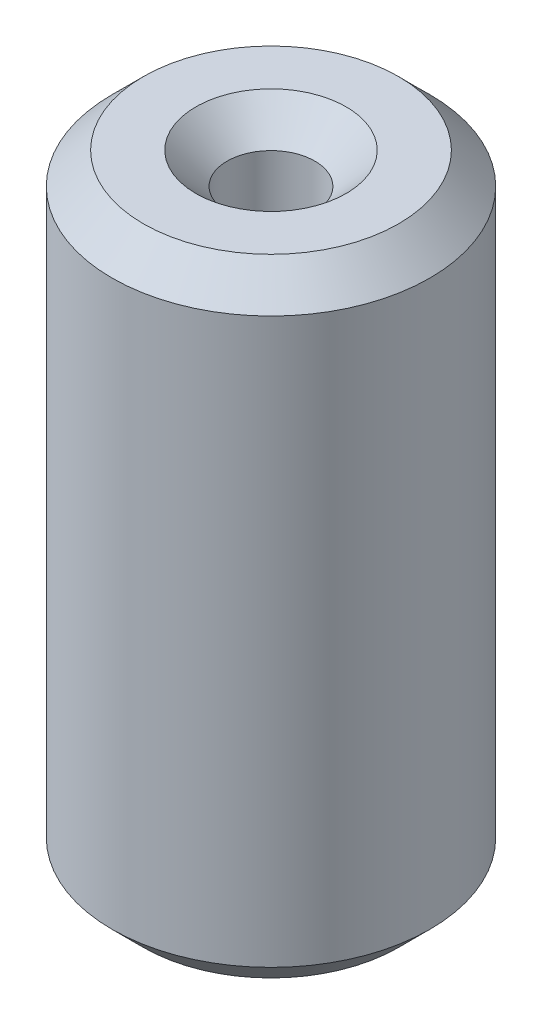
ISO-10303-21;
HEADER;
FILE_DESCRIPTION(('STEP AP214'),'2;1');
FILE_NAME('part.step','',(''),(''),'','','');
FILE_SCHEMA(('AUTOMOTIVE_DESIGN { 1 0 10303 214 1 1 1 1 }'));
ENDSEC;
DATA;
#1=APPLICATION_CONTEXT('core data for automotive mechanical design processes');
#2=APPLICATION_PROTOCOL_DEFINITION('international standard','automotive_design',2000,#1);
#3=PRODUCT_CONTEXT('',#1,'mechanical');
#4=PRODUCT('Part','Part','',(#3));
#5=PRODUCT_RELATED_PRODUCT_CATEGORY('part','',(#4));
#6=PRODUCT_DEFINITION_FORMATION('','',#4);
#7=PRODUCT_DEFINITION_CONTEXT('part definition',#1,'design');
#8=PRODUCT_DEFINITION('design','',#6,#7);
#9=PRODUCT_DEFINITION_SHAPE('','',#8);
#10=(LENGTH_UNIT() NAMED_UNIT(*) SI_UNIT(.MILLI.,.METRE.));
#11=(NAMED_UNIT(*) PLANE_ANGLE_UNIT() SI_UNIT($,.RADIAN.));
#12=(NAMED_UNIT(*) SI_UNIT($,.STERADIAN.) SOLID_ANGLE_UNIT());
#13=UNCERTAINTY_MEASURE_WITH_UNIT(LENGTH_MEASURE(1.E-05),#10,'distance_accuracy_value','');
#14=(GEOMETRIC_REPRESENTATION_CONTEXT(3) GLOBAL_UNCERTAINTY_ASSIGNED_CONTEXT((#13)) GLOBAL_UNIT_ASSIGNED_CONTEXT((#10,
#11,#12)) REPRESENTATION_CONTEXT('',''));
#15=CARTESIAN_POINT('',(0.,0.,0.));
#16=DIRECTION('',(0.,0.,1.));
#17=DIRECTION('',(1.,0.,0.));
#18=AXIS2_PLACEMENT_3D('',#15,#16,#17);
#19=CARTESIAN_POINT('',(0.,19.7202481546012,0.));
#20=DIRECTION('',(0.,-1.,0.));
#21=DIRECTION('',(0.,0.,-1.));
#22=AXIS2_PLACEMENT_3D('',#19,#20,#21);
#23=CYLINDRICAL_SURFACE('',#22,5.);
#24=CARTESIAN_POINT('',(0.,0.985582818961623,0.));
#25=DIRECTION('',(0.,1.,0.));
#26=DIRECTION('',(0.,0.,1.));
#27=AXIS2_PLACEMENT_3D('',#24,#25,#26);
#28=CIRCLE('',#27,5.);
#29=CARTESIAN_POINT('',(0.,0.985582818961623,5.));
#30=VERTEX_POINT('',#29);
#31=EDGE_CURVE('E10',#30,#30,#28,.T.);
#32=ORIENTED_EDGE('',*,*,#31,.T.);
#33=EDGE_LOOP('',(#32));
#34=FACE_BOUND('',#33,.T.);
#35=CARTESIAN_POINT('',(0.,18.7346653356395,0.));
#36=DIRECTION('',(0.,1.,0.));
#37=DIRECTION('',(0.,0.,1.));
#38=AXIS2_PLACEMENT_3D('',#35,#36,#37);
#39=CIRCLE('',#38,5.);
#40=CARTESIAN_POINT('',(0.,18.7346653356395,5.));
#41=VERTEX_POINT('',#40);
#42=EDGE_CURVE('E50',#41,#41,#39,.F.);
#43=ORIENTED_EDGE('',*,*,#42,.T.);
#44=EDGE_LOOP('',(#43));
#45=FACE_BOUND('',#44,.T.);
#46=ADVANCED_FACE('F39',(#34,#45),#23,.T.);
#47=CARTESIAN_POINT('',(0.,19.7202481546012,0.));
#48=DIRECTION('',(0.,1.,0.));
#49=DIRECTION('',(0.,0.,1.));
#50=AXIS2_PLACEMENT_3D('',#47,#48,#49);
#51=PLANE('',#50);
#52=CARTESIAN_POINT('',(0.,19.7202481546012,0.));
#53=DIRECTION('',(0.,1.,0.));
#54=DIRECTION('',(0.,0.,1.));
#55=AXIS2_PLACEMENT_3D('',#52,#53,#54);
#56=CIRCLE('',#55,2.36435677409121);
#57=CARTESIAN_POINT('',(0.,19.7202481546012,2.36435677409121));
#58=VERTEX_POINT('',#57);
#59=EDGE_CURVE('E58',#58,#58,#56,.F.);
#60=ORIENTED_EDGE('',*,*,#59,.T.);
#61=EDGE_LOOP('',(#60));
#62=FACE_BOUND('',#61,.T.);
#63=CARTESIAN_POINT('',(0.,19.7202481546012,0.));
#64=DIRECTION('',(0.,1.,0.));
#65=DIRECTION('',(0.,0.,1.));
#66=AXIS2_PLACEMENT_3D('',#63,#64,#65);
#67=CIRCLE('',#66,4.01441718103837);
#68=CARTESIAN_POINT('',(0.,19.7202481546012,4.01441718103837));
#69=VERTEX_POINT('',#68);
#70=EDGE_CURVE('E61',#69,#69,#67,.T.);
#71=ORIENTED_EDGE('',*,*,#70,.T.);
#72=EDGE_LOOP('',(#71));
#73=FACE_BOUND('',#72,.T.);
#74=ADVANCED_FACE('F88',(#62,#73),#51,.T.);
#75=CARTESIAN_POINT('',(0.,0.,0.));
#76=DIRECTION('',(0.,1.,0.));
#77=DIRECTION('',(0.,0.,1.));
#78=AXIS2_PLACEMENT_3D('',#75,#76,#77);
#79=PLANE('',#78);
#80=CARTESIAN_POINT('',(0.,0.,0.));
#81=DIRECTION('',(0.,1.,0.));
#82=DIRECTION('',(0.,0.,1.));
#83=AXIS2_PLACEMENT_3D('',#80,#81,#82);
#84=CIRCLE('',#83,2.3643567740912);
#85=CARTESIAN_POINT('',(0.,0.,2.3643567740912));
#86=VERTEX_POINT('',#85);
#87=EDGE_CURVE('E51',#86,#86,#84,.T.);
#88=ORIENTED_EDGE('',*,*,#87,.T.);
#89=EDGE_LOOP('',(#88));
#90=FACE_BOUND('',#89,.T.);
#91=CARTESIAN_POINT('',(0.,0.,0.));
#92=DIRECTION('',(0.,1.,0.));
#93=DIRECTION('',(0.,0.,1.));
#94=AXIS2_PLACEMENT_3D('',#91,#92,#93);
#95=CIRCLE('',#94,4.01441718103837);
#96=CARTESIAN_POINT('',(0.,0.,4.01441718103837));
#97=VERTEX_POINT('',#96);
#98=EDGE_CURVE('E54',#97,#97,#95,.F.);
#99=ORIENTED_EDGE('',*,*,#98,.T.);
#100=EDGE_LOOP('',(#99));
#101=FACE_BOUND('',#100,.T.);
#102=ADVANCED_FACE('F83',(#90,#101),#79,.F.);
#103=CARTESIAN_POINT('',(0.,19.7202481546012,0.));
#104=DIRECTION('',(0.,-1.,0.));
#105=DIRECTION('',(0.,0.,-1.));
#106=AXIS2_PLACEMENT_3D('',#103,#104,#105);
#107=CYLINDRICAL_SURFACE('',#106,1.37877395512958);
#108=CARTESIAN_POINT('',(0.,18.7346653356395,0.));
#109=DIRECTION('',(0.,1.,0.));
#110=DIRECTION('',(0.,0.,1.));
#111=AXIS2_PLACEMENT_3D('',#108,#109,#110);
#112=CIRCLE('',#111,1.37877395512958);
#113=CARTESIAN_POINT('',(0.,18.7346653356395,1.37877395512958));
#114=VERTEX_POINT('',#113);
#115=EDGE_CURVE('E67',#114,#114,#112,.T.);
#116=ORIENTED_EDGE('',*,*,#115,.T.);
#117=EDGE_LOOP('',(#116));
#118=FACE_BOUND('',#117,.T.);
#119=CARTESIAN_POINT('',(0.,0.98558281896163,0.));
#120=DIRECTION('',(0.,1.,0.));
#121=DIRECTION('',(0.,0.,1.));
#122=AXIS2_PLACEMENT_3D('',#119,#120,#121);
#123=CIRCLE('',#122,1.37877395512958);
#124=CARTESIAN_POINT('',(0.,0.98558281896163,1.37877395512958));
#125=VERTEX_POINT('',#124);
#126=EDGE_CURVE('E69',#125,#125,#123,.F.);
#127=ORIENTED_EDGE('',*,*,#126,.T.);
#128=EDGE_LOOP('',(#127));
#129=FACE_BOUND('',#128,.T.);
#130=ADVANCED_FACE('F71',(#118,#129),#107,.F.);
#131=CARTESIAN_POINT('',(0.,18.7346653356395,0.));
#132=DIRECTION('',(0.,1.,0.));
#133=DIRECTION('',(0.,0.,1.));
#134=AXIS2_PLACEMENT_3D('',#131,#132,#133);
#135=CONICAL_SURFACE('',#134,1.37877395512958,0.785398163397451);
#136=ORIENTED_EDGE('',*,*,#59,.F.);
#137=EDGE_LOOP('',(#136));
#138=FACE_BOUND('',#137,.T.);
#139=ORIENTED_EDGE('',*,*,#115,.F.);
#140=EDGE_LOOP('',(#139));
#141=FACE_BOUND('',#140,.T.);
#142=ADVANCED_FACE('F77',(#138,#141),#135,.F.);
#143=CARTESIAN_POINT('',(0.,0.,0.));
#144=DIRECTION('',(0.,-1.,0.));
#145=DIRECTION('',(0.,0.,-1.));
#146=AXIS2_PLACEMENT_3D('',#143,#144,#145);
#147=CONICAL_SURFACE('',#146,2.3643567740912,0.785398163397444);
#148=ORIENTED_EDGE('',*,*,#126,.F.);
#149=EDGE_LOOP('',(#148));
#150=FACE_BOUND('',#149,.T.);
#151=ORIENTED_EDGE('',*,*,#87,.F.);
#152=EDGE_LOOP('',(#151));
#153=FACE_BOUND('',#152,.T.);
#154=ADVANCED_FACE('F73',(#150,#153),#147,.F.);
#155=CARTESIAN_POINT('',(0.,0.985582818961623,0.));
#156=DIRECTION('',(0.,1.,0.));
#157=DIRECTION('',(0.,0.,1.));
#158=AXIS2_PLACEMENT_3D('',#155,#156,#157);
#159=CONICAL_SURFACE('',#158,5.,0.785398163397451);
#160=ORIENTED_EDGE('',*,*,#98,.F.);
#161=EDGE_LOOP('',(#160));
#162=FACE_BOUND('',#161,.T.);
#163=ORIENTED_EDGE('',*,*,#31,.F.);
#164=EDGE_LOOP('',(#163));
#165=FACE_BOUND('',#164,.T.);
#166=ADVANCED_FACE('F76',(#162,#165),#159,.T.);
#167=CARTESIAN_POINT('',(0.,19.7202481546012,0.));
#168=DIRECTION('',(0.,-1.,0.));
#169=DIRECTION('',(0.,0.,-1.));
#170=AXIS2_PLACEMENT_3D('',#167,#168,#169);
#171=CONICAL_SURFACE('',#170,4.01441718103837,0.785398163397444);
#172=ORIENTED_EDGE('',*,*,#42,.F.);
#173=EDGE_LOOP('',(#172));
#174=FACE_BOUND('',#173,.T.);
#175=ORIENTED_EDGE('',*,*,#70,.F.);
#176=EDGE_LOOP('',(#175));
#177=FACE_BOUND('',#176,.T.);
#178=ADVANCED_FACE('F45',(#174,#177),#171,.T.);
#179=CLOSED_SHELL('',(#46,#74,#102,#130,#142,#154,#166,#178));
#180=MANIFOLD_SOLID_BREP('B2',#179);
#181=ADVANCED_BREP_SHAPE_REPRESENTATION('',(#18,#180),#14);
#182=SHAPE_DEFINITION_REPRESENTATION(#9,#181);
ENDSEC;
END-ISO-10303-21;
